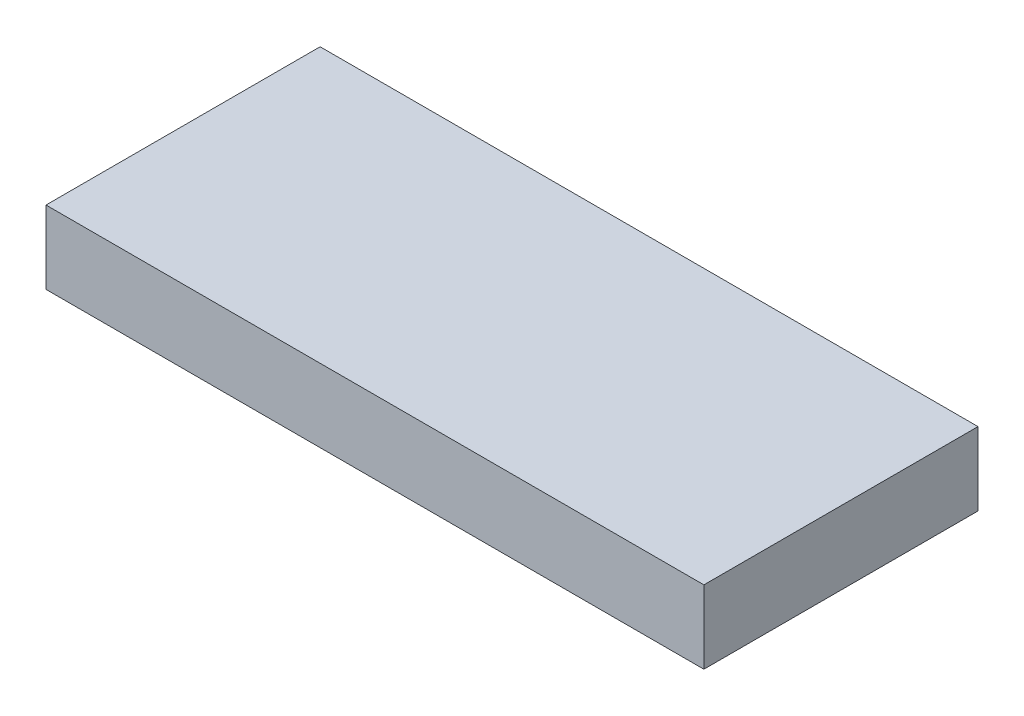
ISO-10303-21;
HEADER;
FILE_DESCRIPTION(('STEP AP214'),'2;1');
FILE_NAME('part.step','',(''),(''),'','','');
FILE_SCHEMA(('AUTOMOTIVE_DESIGN { 1 0 10303 214 1 1 1 1 }'));
ENDSEC;
DATA;
#1=APPLICATION_CONTEXT('core data for automotive mechanical design processes');
#2=APPLICATION_PROTOCOL_DEFINITION('international standard','automotive_design',2000,#1);
#3=PRODUCT_CONTEXT('',#1,'mechanical');
#4=PRODUCT('Part','Part','',(#3));
#5=PRODUCT_RELATED_PRODUCT_CATEGORY('part','',(#4));
#6=PRODUCT_DEFINITION_FORMATION('','',#4);
#7=PRODUCT_DEFINITION_CONTEXT('part definition',#1,'design');
#8=PRODUCT_DEFINITION('design','',#6,#7);
#9=PRODUCT_DEFINITION_SHAPE('','',#8);
#10=(LENGTH_UNIT() NAMED_UNIT(*) SI_UNIT(.MILLI.,.METRE.));
#11=(NAMED_UNIT(*) PLANE_ANGLE_UNIT() SI_UNIT($,.RADIAN.));
#12=(NAMED_UNIT(*) SI_UNIT($,.STERADIAN.) SOLID_ANGLE_UNIT());
#13=UNCERTAINTY_MEASURE_WITH_UNIT(LENGTH_MEASURE(1.E-05),#10,'distance_accuracy_value','');
#14=(GEOMETRIC_REPRESENTATION_CONTEXT(3) GLOBAL_UNCERTAINTY_ASSIGNED_CONTEXT((#13)) GLOBAL_UNIT_ASSIGNED_CONTEXT((#10,
#11,#12)) REPRESENTATION_CONTEXT('',''));
#15=CARTESIAN_POINT('',(0.,0.,0.));
#16=DIRECTION('',(0.,0.,1.));
#17=DIRECTION('',(1.,0.,0.));
#18=AXIS2_PLACEMENT_3D('',#15,#16,#17);
#19=CARTESIAN_POINT('',(122.155998981093,4.699,-130.518999433778));
#20=DIRECTION('',(1.,0.,0.));
#21=DIRECTION('',(0.,0.,-1.));
#22=AXIS2_PLACEMENT_3D('',#19,#20,#21);
#23=PLANE('',#22);
#24=DIRECTION('',(0.,0.,-1.));
#25=VECTOR('',#24,1.);
#26=CARTESIAN_POINT('',(122.155998981093,14.859,-130.518999433778));
#27=LINE('',#26,#25);
#28=CARTESIAN_POINT('',(122.155998981093,14.859,-130.518999433778));
#29=VERTEX_POINT('',#28);
#30=CARTESIAN_POINT('',(122.155998981093,14.859,-168.618999433778));
#31=VERTEX_POINT('',#30);
#32=EDGE_CURVE('E96',#29,#31,#27,.T.);
#33=ORIENTED_EDGE('',*,*,#32,.F.);
#34=DIRECTION('',(0.,1.,0.));
#35=VECTOR('',#34,1.);
#36=CARTESIAN_POINT('',(122.155998981093,4.699,-130.518999433778));
#37=LINE('',#36,#35);
#38=CARTESIAN_POINT('',(122.155998981093,4.699,-130.518999433778));
#39=VERTEX_POINT('',#38);
#40=EDGE_CURVE('E11',#39,#29,#37,.T.);
#41=ORIENTED_EDGE('',*,*,#40,.F.);
#42=DIRECTION('',(0.,0.,-1.));
#43=VECTOR('',#42,1.);
#44=CARTESIAN_POINT('',(122.155998981093,4.699,-130.518999433778));
#45=LINE('',#44,#43);
#46=CARTESIAN_POINT('',(122.155998981093,4.699,-168.618999433778));
#47=VERTEX_POINT('',#46);
#48=EDGE_CURVE('E90',#39,#47,#45,.T.);
#49=ORIENTED_EDGE('',*,*,#48,.T.);
#50=DIRECTION('',(0.,1.,0.));
#51=VECTOR('',#50,1.);
#52=CARTESIAN_POINT('',(122.155998981093,4.699,-168.618999433778));
#53=LINE('',#52,#51);
#54=EDGE_CURVE('E35',#47,#31,#53,.T.);
#55=ORIENTED_EDGE('',*,*,#54,.T.);
#56=EDGE_LOOP('',(#33,#41,#49,#55));
#57=FACE_BOUND('',#56,.T.);
#58=ADVANCED_FACE('F32',(#57),#23,.T.);
#59=CARTESIAN_POINT('',(122.155998981093,4.699,-130.518999433778));
#60=DIRECTION('',(0.,0.,1.));
#61=DIRECTION('',(1.,0.,0.));
#62=AXIS2_PLACEMENT_3D('',#59,#60,#61);
#63=PLANE('',#62);
#64=DIRECTION('',(1.,0.,0.));
#65=VECTOR('',#64,1.);
#66=CARTESIAN_POINT('',(122.155998981093,14.859,-130.518999433778));
#67=LINE('',#66,#65);
#68=CARTESIAN_POINT('',(30.7159989810932,14.859,-130.518999433778));
#69=VERTEX_POINT('',#68);
#70=EDGE_CURVE('E92',#69,#29,#67,.T.);
#71=ORIENTED_EDGE('',*,*,#70,.F.);
#72=DIRECTION('',(0.,1.,0.));
#73=VECTOR('',#72,1.);
#74=CARTESIAN_POINT('',(30.7159989810932,4.699,-130.518999433778));
#75=LINE('',#74,#73);
#76=CARTESIAN_POINT('',(30.7159989810932,4.699,-130.518999433778));
#77=VERTEX_POINT('',#76);
#78=EDGE_CURVE('E41',#77,#69,#75,.T.);
#79=ORIENTED_EDGE('',*,*,#78,.F.);
#80=DIRECTION('',(1.,0.,0.));
#81=VECTOR('',#80,1.);
#82=CARTESIAN_POINT('',(122.155998981093,4.699,-130.518999433778));
#83=LINE('',#82,#81);
#84=EDGE_CURVE('E87',#77,#39,#83,.T.);
#85=ORIENTED_EDGE('',*,*,#84,.T.);
#86=ORIENTED_EDGE('',*,*,#40,.T.);
#87=EDGE_LOOP('',(#71,#79,#85,#86));
#88=FACE_BOUND('',#87,.T.);
#89=ADVANCED_FACE('F106',(#88),#63,.T.);
#90=CARTESIAN_POINT('',(30.7159989810932,4.699,-130.518999433778));
#91=DIRECTION('',(-1.,0.,0.));
#92=DIRECTION('',(0.,0.,1.));
#93=AXIS2_PLACEMENT_3D('',#90,#91,#92);
#94=PLANE('',#93);
#95=DIRECTION('',(0.,0.,1.));
#96=VECTOR('',#95,1.);
#97=CARTESIAN_POINT('',(30.7159989810932,14.859,-130.518999433778));
#98=LINE('',#97,#96);
#99=CARTESIAN_POINT('',(30.7159989810932,14.859,-168.618999433778));
#100=VERTEX_POINT('',#99);
#101=EDGE_CURVE('E82',#100,#69,#98,.T.);
#102=ORIENTED_EDGE('',*,*,#101,.F.);
#103=DIRECTION('',(0.,1.,0.));
#104=VECTOR('',#103,1.);
#105=CARTESIAN_POINT('',(30.7159989810932,4.699,-168.618999433778));
#106=LINE('',#105,#104);
#107=CARTESIAN_POINT('',(30.7159989810932,4.699,-168.618999433778));
#108=VERTEX_POINT('',#107);
#109=EDGE_CURVE('E77',#108,#100,#106,.T.);
#110=ORIENTED_EDGE('',*,*,#109,.F.);
#111=DIRECTION('',(0.,0.,1.));
#112=VECTOR('',#111,1.);
#113=CARTESIAN_POINT('',(30.7159989810932,4.699,-130.518999433778));
#114=LINE('',#113,#112);
#115=EDGE_CURVE('E80',#108,#77,#114,.T.);
#116=ORIENTED_EDGE('',*,*,#115,.T.);
#117=ORIENTED_EDGE('',*,*,#78,.T.);
#118=EDGE_LOOP('',(#102,#110,#116,#117));
#119=FACE_BOUND('',#118,.T.);
#120=ADVANCED_FACE('F79',(#119),#94,.T.);
#121=CARTESIAN_POINT('',(122.155998981093,4.699,-168.618999433778));
#122=DIRECTION('',(0.,0.,-1.));
#123=DIRECTION('',(-1.,0.,0.));
#124=AXIS2_PLACEMENT_3D('',#121,#122,#123);
#125=PLANE('',#124);
#126=DIRECTION('',(-1.,0.,0.));
#127=VECTOR('',#126,1.);
#128=CARTESIAN_POINT('',(122.155998981093,14.859,-168.618999433778));
#129=LINE('',#128,#127);
#130=EDGE_CURVE('E99',#31,#100,#129,.T.);
#131=ORIENTED_EDGE('',*,*,#130,.F.);
#132=ORIENTED_EDGE('',*,*,#54,.F.);
#133=DIRECTION('',(-1.,0.,0.));
#134=VECTOR('',#133,1.);
#135=CARTESIAN_POINT('',(122.155998981093,4.699,-168.618999433778));
#136=LINE('',#135,#134);
#137=EDGE_CURVE('E86',#47,#108,#136,.T.);
#138=ORIENTED_EDGE('',*,*,#137,.T.);
#139=ORIENTED_EDGE('',*,*,#109,.T.);
#140=EDGE_LOOP('',(#131,#132,#138,#139));
#141=FACE_BOUND('',#140,.T.);
#142=ADVANCED_FACE('F89',(#141),#125,.T.);
#143=CARTESIAN_POINT('',(0.,4.699,0.));
#144=DIRECTION('',(0.,1.,0.));
#145=DIRECTION('',(0.,0.,1.));
#146=AXIS2_PLACEMENT_3D('',#143,#144,#145);
#147=PLANE('',#146);
#148=ORIENTED_EDGE('',*,*,#48,.F.);
#149=ORIENTED_EDGE('',*,*,#84,.F.);
#150=ORIENTED_EDGE('',*,*,#115,.F.);
#151=ORIENTED_EDGE('',*,*,#137,.F.);
#152=EDGE_LOOP('',(#148,#149,#150,#151));
#153=FACE_BOUND('',#152,.T.);
#154=ADVANCED_FACE('F85',(#153),#147,.F.);
#155=CARTESIAN_POINT('',(0.,14.859,0.));
#156=DIRECTION('',(0.,1.,0.));
#157=DIRECTION('',(0.,0.,1.));
#158=AXIS2_PLACEMENT_3D('',#155,#156,#157);
#159=PLANE('',#158);
#160=ORIENTED_EDGE('',*,*,#32,.T.);
#161=ORIENTED_EDGE('',*,*,#130,.T.);
#162=ORIENTED_EDGE('',*,*,#101,.T.);
#163=ORIENTED_EDGE('',*,*,#70,.T.);
#164=EDGE_LOOP('',(#160,#161,#162,#163));
#165=FACE_BOUND('',#164,.T.);
#166=ADVANCED_FACE('F105',(#165),#159,.T.);
#167=CLOSED_SHELL('',(#58,#89,#120,#142,#154,#166));
#168=MANIFOLD_SOLID_BREP('B2',#167);
#169=ADVANCED_BREP_SHAPE_REPRESENTATION('',(#18,#168),#14);
#170=SHAPE_DEFINITION_REPRESENTATION(#9,#169);
ENDSEC;
END-ISO-10303-21;
